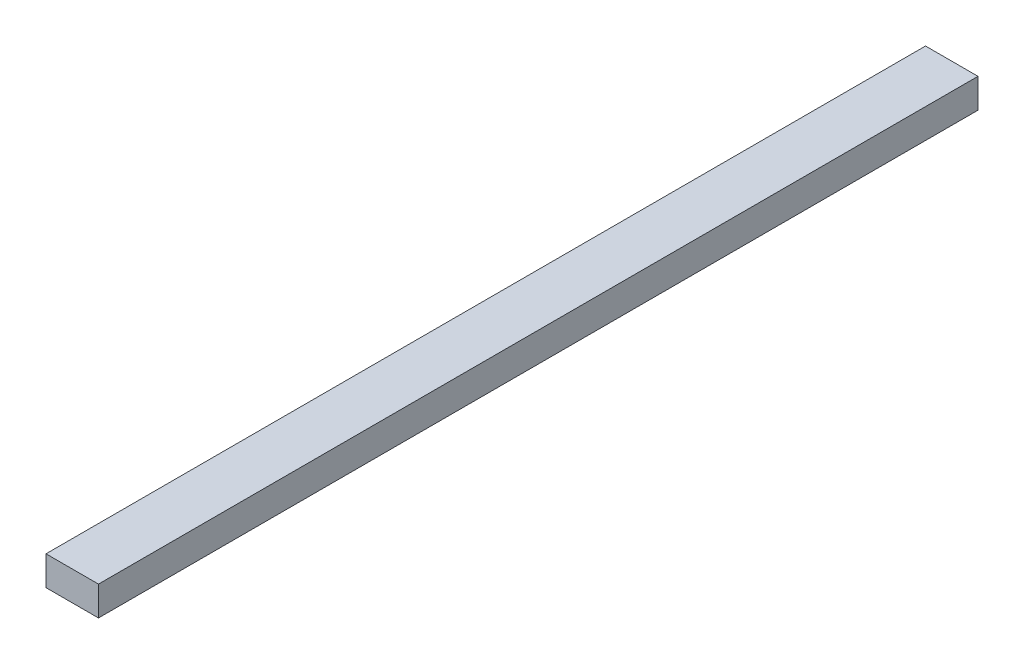
ISO-10303-21;
HEADER;
FILE_DESCRIPTION(('STEP AP214'),'2;1');
FILE_NAME('part.step','',(''),(''),'','','');
FILE_SCHEMA(('AUTOMOTIVE_DESIGN { 1 0 10303 214 1 1 1 1 }'));
ENDSEC;
DATA;
#1=APPLICATION_CONTEXT('core data for automotive mechanical design processes');
#2=APPLICATION_PROTOCOL_DEFINITION('international standard','automotive_design',2000,#1);
#3=PRODUCT_CONTEXT('',#1,'mechanical');
#4=PRODUCT('Part','Part','',(#3));
#5=PRODUCT_RELATED_PRODUCT_CATEGORY('part','',(#4));
#6=PRODUCT_DEFINITION_FORMATION('','',#4);
#7=PRODUCT_DEFINITION_CONTEXT('part definition',#1,'design');
#8=PRODUCT_DEFINITION('design','',#6,#7);
#9=PRODUCT_DEFINITION_SHAPE('','',#8);
#10=(LENGTH_UNIT() NAMED_UNIT(*) SI_UNIT(.MILLI.,.METRE.));
#11=(NAMED_UNIT(*) PLANE_ANGLE_UNIT() SI_UNIT($,.RADIAN.));
#12=(NAMED_UNIT(*) SI_UNIT($,.STERADIAN.) SOLID_ANGLE_UNIT());
#13=UNCERTAINTY_MEASURE_WITH_UNIT(LENGTH_MEASURE(1.E-05),#10,'distance_accuracy_value','');
#14=(GEOMETRIC_REPRESENTATION_CONTEXT(3) GLOBAL_UNCERTAINTY_ASSIGNED_CONTEXT((#13)) GLOBAL_UNIT_ASSIGNED_CONTEXT((#10,
#11,#12)) REPRESENTATION_CONTEXT('',''));
#15=CARTESIAN_POINT('',(0.,0.,0.));
#16=DIRECTION('',(0.,0.,1.));
#17=DIRECTION('',(1.,0.,0.));
#18=AXIS2_PLACEMENT_3D('',#15,#16,#17);
#19=CARTESIAN_POINT('',(0.,29.591,0.));
#20=DIRECTION('',(0.,1.,0.));
#21=DIRECTION('',(0.,0.,1.));
#22=AXIS2_PLACEMENT_3D('',#19,#20,#21);
#23=PLANE('',#22);
#24=DIRECTION('',(1.,0.,0.));
#25=VECTOR('',#24,1.);
#26=CARTESIAN_POINT('',(0.,29.591,24.511));
#27=LINE('',#26,#25);
#28=CARTESIAN_POINT('',(-18.161,29.591,24.511));
#29=VERTEX_POINT('',#28);
#30=CARTESIAN_POINT('',(18.161,29.591,24.511));
#31=VERTEX_POINT('',#30);
#32=EDGE_CURVE('E97',#29,#31,#27,.T.);
#33=ORIENTED_EDGE('',*,*,#32,.F.);
#34=DIRECTION('',(0.,0.,1.));
#35=VECTOR('',#34,1.);
#36=CARTESIAN_POINT('',(-18.161,29.591,0.));
#37=LINE('',#36,#35);
#38=CARTESIAN_POINT('',(-18.161,29.591,-584.2));
#39=VERTEX_POINT('',#38);
#40=EDGE_CURVE('E95',#39,#29,#37,.T.);
#41=ORIENTED_EDGE('',*,*,#40,.F.);
#42=DIRECTION('',(1.,0.,0.));
#43=VECTOR('',#42,1.);
#44=CARTESIAN_POINT('',(0.,29.591,-584.2));
#45=LINE('',#44,#43);
#46=CARTESIAN_POINT('',(18.161,29.591,-584.2));
#47=VERTEX_POINT('',#46);
#48=EDGE_CURVE('E65',#39,#47,#45,.T.);
#49=ORIENTED_EDGE('',*,*,#48,.T.);
#50=DIRECTION('',(0.,0.,1.));
#51=VECTOR('',#50,1.);
#52=CARTESIAN_POINT('',(18.161,29.591,0.));
#53=LINE('',#52,#51);
#54=EDGE_CURVE('E96',#47,#31,#53,.T.);
#55=ORIENTED_EDGE('',*,*,#54,.T.);
#56=EDGE_LOOP('',(#33,#41,#49,#55));
#57=FACE_BOUND('',#56,.T.);
#58=ADVANCED_FACE('F43',(#57),#23,.F.);
#59=CARTESIAN_POINT('',(-18.161,0.,0.));
#60=DIRECTION('',(1.,0.,0.));
#61=DIRECTION('',(0.,0.,-1.));
#62=AXIS2_PLACEMENT_3D('',#59,#60,#61);
#63=PLANE('',#62);
#64=DIRECTION('',(0.,-1.,0.));
#65=VECTOR('',#64,1.);
#66=CARTESIAN_POINT('',(-18.161,0.,24.511));
#67=LINE('',#66,#65);
#68=CARTESIAN_POINT('',(-18.161,49.911,24.511));
#69=VERTEX_POINT('',#68);
#70=EDGE_CURVE('E83',#69,#29,#67,.T.);
#71=ORIENTED_EDGE('',*,*,#70,.F.);
#72=DIRECTION('',(0.,0.,1.));
#73=VECTOR('',#72,1.);
#74=CARTESIAN_POINT('',(-18.161,49.911,25.4));
#75=LINE('',#74,#73);
#76=CARTESIAN_POINT('',(-18.161,49.911,-584.2));
#77=VERTEX_POINT('',#76);
#78=EDGE_CURVE('E94',#77,#69,#75,.T.);
#79=ORIENTED_EDGE('',*,*,#78,.F.);
#80=DIRECTION('',(0.,-1.,0.));
#81=VECTOR('',#80,1.);
#82=CARTESIAN_POINT('',(-18.161,0.,-584.2));
#83=LINE('',#82,#81);
#84=EDGE_CURVE('E105',#77,#39,#83,.T.);
#85=ORIENTED_EDGE('',*,*,#84,.T.);
#86=ORIENTED_EDGE('',*,*,#40,.T.);
#87=EDGE_LOOP('',(#71,#79,#85,#86));
#88=FACE_BOUND('',#87,.T.);
#89=ADVANCED_FACE('F92',(#88),#63,.F.);
#90=CARTESIAN_POINT('',(18.161,0.,0.));
#91=DIRECTION('',(1.,0.,0.));
#92=DIRECTION('',(0.,0.,-1.));
#93=AXIS2_PLACEMENT_3D('',#90,#91,#92);
#94=PLANE('',#93);
#95=DIRECTION('',(0.,0.,1.));
#96=VECTOR('',#95,1.);
#97=CARTESIAN_POINT('',(18.161,49.911,25.4));
#98=LINE('',#97,#96);
#99=CARTESIAN_POINT('',(18.161,49.911,-584.2));
#100=VERTEX_POINT('',#99);
#101=CARTESIAN_POINT('',(18.161,49.911,24.511));
#102=VERTEX_POINT('',#101);
#103=EDGE_CURVE('E103',#100,#102,#98,.T.);
#104=ORIENTED_EDGE('',*,*,#103,.T.);
#105=DIRECTION('',(0.,-1.,0.));
#106=VECTOR('',#105,1.);
#107=CARTESIAN_POINT('',(18.161,0.,24.511));
#108=LINE('',#107,#106);
#109=EDGE_CURVE('E57',#102,#31,#108,.T.);
#110=ORIENTED_EDGE('',*,*,#109,.T.);
#111=ORIENTED_EDGE('',*,*,#54,.F.);
#112=DIRECTION('',(0.,-1.,0.));
#113=VECTOR('',#112,1.);
#114=CARTESIAN_POINT('',(18.161,0.,-584.2));
#115=LINE('',#114,#113);
#116=EDGE_CURVE('E51',#100,#47,#115,.T.);
#117=ORIENTED_EDGE('',*,*,#116,.F.);
#118=EDGE_LOOP('',(#104,#110,#111,#117));
#119=FACE_BOUND('',#118,.T.);
#120=ADVANCED_FACE('F117',(#119),#94,.T.);
#121=CARTESIAN_POINT('',(-49.911,49.911,25.4));
#122=DIRECTION('',(0.,-1.,0.));
#123=DIRECTION('',(0.,0.,-1.));
#124=AXIS2_PLACEMENT_3D('',#121,#122,#123);
#125=PLANE('',#124);
#126=DIRECTION('',(-1.,0.,0.));
#127=VECTOR('',#126,1.);
#128=CARTESIAN_POINT('',(-49.911,49.911,24.511));
#129=LINE('',#128,#127);
#130=EDGE_CURVE('E11',#102,#69,#129,.T.);
#131=ORIENTED_EDGE('',*,*,#130,.F.);
#132=ORIENTED_EDGE('',*,*,#103,.F.);
#133=DIRECTION('',(-1.,0.,0.));
#134=VECTOR('',#133,1.);
#135=CARTESIAN_POINT('',(-49.911,49.911,-584.2));
#136=LINE('',#135,#134);
#137=EDGE_CURVE('E101',#100,#77,#136,.T.);
#138=ORIENTED_EDGE('',*,*,#137,.T.);
#139=ORIENTED_EDGE('',*,*,#78,.T.);
#140=EDGE_LOOP('',(#131,#132,#138,#139));
#141=FACE_BOUND('',#140,.T.);
#142=ADVANCED_FACE('F99',(#141),#125,.F.);
#143=CARTESIAN_POINT('',(0.,0.,-584.2));
#144=DIRECTION('',(0.,0.,1.));
#145=DIRECTION('',(1.,0.,0.));
#146=AXIS2_PLACEMENT_3D('',#143,#144,#145);
#147=PLANE('',#146);
#148=ORIENTED_EDGE('',*,*,#84,.F.);
#149=ORIENTED_EDGE('',*,*,#137,.F.);
#150=ORIENTED_EDGE('',*,*,#116,.T.);
#151=ORIENTED_EDGE('',*,*,#48,.F.);
#152=EDGE_LOOP('',(#148,#149,#150,#151));
#153=FACE_BOUND('',#152,.T.);
#154=ADVANCED_FACE('F45',(#153),#147,.F.);
#155=CARTESIAN_POINT('',(0.,0.,24.511));
#156=DIRECTION('',(0.,0.,1.));
#157=DIRECTION('',(1.,0.,0.));
#158=AXIS2_PLACEMENT_3D('',#155,#156,#157);
#159=PLANE('',#158);
#160=ORIENTED_EDGE('',*,*,#70,.T.);
#161=ORIENTED_EDGE('',*,*,#32,.T.);
#162=ORIENTED_EDGE('',*,*,#109,.F.);
#163=ORIENTED_EDGE('',*,*,#130,.T.);
#164=EDGE_LOOP('',(#160,#161,#162,#163));
#165=FACE_BOUND('',#164,.T.);
#166=ADVANCED_FACE('F82',(#165),#159,.T.);
#167=CLOSED_SHELL('',(#58,#89,#120,#142,#154,#166));
#168=MANIFOLD_SOLID_BREP('B2',#167);
#169=ADVANCED_BREP_SHAPE_REPRESENTATION('',(#18,#168),#14);
#170=SHAPE_DEFINITION_REPRESENTATION(#9,#169);
ENDSEC;
END-ISO-10303-21;
